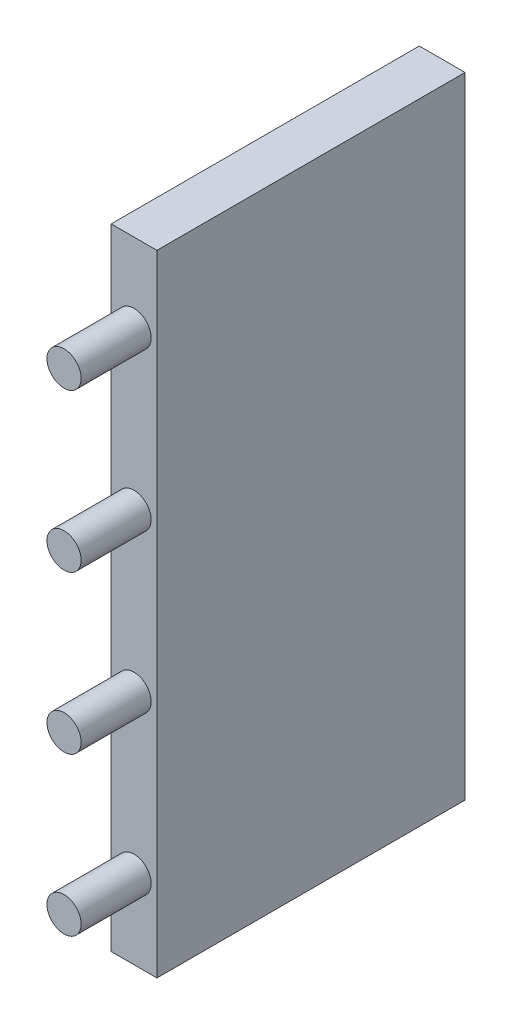
ISO-10303-21;
HEADER;
FILE_DESCRIPTION(('STEP AP214'),'2;1');
FILE_NAME('part.step','',(''),(''),'','','');
FILE_SCHEMA(('AUTOMOTIVE_DESIGN { 1 0 10303 214 1 1 1 1 }'));
ENDSEC;
DATA;
#1=APPLICATION_CONTEXT('core data for automotive mechanical design processes');
#2=APPLICATION_PROTOCOL_DEFINITION('international standard','automotive_design',2000,#1);
#3=PRODUCT_CONTEXT('',#1,'mechanical');
#4=PRODUCT('Part','Part','',(#3));
#5=PRODUCT_RELATED_PRODUCT_CATEGORY('part','',(#4));
#6=PRODUCT_DEFINITION_FORMATION('','',#4);
#7=PRODUCT_DEFINITION_CONTEXT('part definition',#1,'design');
#8=PRODUCT_DEFINITION('design','',#6,#7);
#9=PRODUCT_DEFINITION_SHAPE('','',#8);
#10=(LENGTH_UNIT() NAMED_UNIT(*) SI_UNIT(.MILLI.,.METRE.));
#11=(NAMED_UNIT(*) PLANE_ANGLE_UNIT() SI_UNIT($,.RADIAN.));
#12=(NAMED_UNIT(*) SI_UNIT($,.STERADIAN.) SOLID_ANGLE_UNIT());
#13=UNCERTAINTY_MEASURE_WITH_UNIT(LENGTH_MEASURE(1.E-05),#10,'distance_accuracy_value','');
#14=(GEOMETRIC_REPRESENTATION_CONTEXT(3) GLOBAL_UNCERTAINTY_ASSIGNED_CONTEXT((#13)) GLOBAL_UNIT_ASSIGNED_CONTEXT((#10,
#11,#12)) REPRESENTATION_CONTEXT('',''));
#15=CARTESIAN_POINT('',(0.,0.,0.));
#16=DIRECTION('',(0.,0.,1.));
#17=DIRECTION('',(1.,0.,0.));
#18=AXIS2_PLACEMENT_3D('',#15,#16,#17);
#19=CARTESIAN_POINT('',(8.3,57.15,27.94));
#20=DIRECTION('',(0.,0.,-1.));
#21=DIRECTION('',(0.,1.,0.));
#22=AXIS2_PLACEMENT_3D('',#19,#20,#21);
#23=PLANE('',#22);
#24=CARTESIAN_POINT('',(4.15,14.2875,27.94));
#25=DIRECTION('',(0.,0.,-1.));
#26=DIRECTION('',(0.,1.,0.));
#27=AXIS2_PLACEMENT_3D('',#24,#25,#26);
#28=CIRCLE('',#27,3.1);
#29=CARTESIAN_POINT('',(4.15,17.3875,27.94));
#30=VERTEX_POINT('',#29);
#31=EDGE_CURVE('E42',#30,#30,#28,.F.);
#32=ORIENTED_EDGE('',*,*,#31,.F.);
#33=EDGE_LOOP('',(#32));
#34=FACE_BOUND('',#33,.T.);
#35=CARTESIAN_POINT('',(4.15,-42.8625,27.94));
#36=DIRECTION('',(0.,0.,-1.));
#37=DIRECTION('',(0.,1.,0.));
#38=AXIS2_PLACEMENT_3D('',#35,#36,#37);
#39=CIRCLE('',#38,3.1);
#40=CARTESIAN_POINT('',(4.15,-39.7625,27.94));
#41=VERTEX_POINT('',#40);
#42=EDGE_CURVE('E111',#41,#41,#39,.F.);
#43=ORIENTED_EDGE('',*,*,#42,.F.);
#44=EDGE_LOOP('',(#43));
#45=FACE_BOUND('',#44,.T.);
#46=DIRECTION('',(0.,-1.,0.));
#47=VECTOR('',#46,1.);
#48=CARTESIAN_POINT('',(0.,57.15,27.94));
#49=LINE('',#48,#47);
#50=CARTESIAN_POINT('',(0.,57.15,27.94));
#51=VERTEX_POINT('',#50);
#52=CARTESIAN_POINT('',(0.,-57.15,27.94));
#53=VERTEX_POINT('',#52);
#54=EDGE_CURVE('E101',#51,#53,#49,.T.);
#55=ORIENTED_EDGE('',*,*,#54,.T.);
#56=DIRECTION('',(-1.,0.,0.));
#57=VECTOR('',#56,1.);
#58=CARTESIAN_POINT('',(8.3,-57.15,27.94));
#59=LINE('',#58,#57);
#60=CARTESIAN_POINT('',(8.3,-57.15,27.94));
#61=VERTEX_POINT('',#60);
#62=EDGE_CURVE('E92',#61,#53,#59,.T.);
#63=ORIENTED_EDGE('',*,*,#62,.F.);
#64=DIRECTION('',(0.,-1.,0.));
#65=VECTOR('',#64,1.);
#66=CARTESIAN_POINT('',(8.3,57.15,27.94));
#67=LINE('',#66,#65);
#68=CARTESIAN_POINT('',(8.3,57.15,27.94));
#69=VERTEX_POINT('',#68);
#70=EDGE_CURVE('E86',#69,#61,#67,.T.);
#71=ORIENTED_EDGE('',*,*,#70,.F.);
#72=DIRECTION('',(-1.,0.,0.));
#73=VECTOR('',#72,1.);
#74=CARTESIAN_POINT('',(8.3,57.15,27.94));
#75=LINE('',#74,#73);
#76=EDGE_CURVE('E97',#69,#51,#75,.T.);
#77=ORIENTED_EDGE('',*,*,#76,.T.);
#78=EDGE_LOOP('',(#55,#63,#71,#77));
#79=FACE_BOUND('',#78,.T.);
#80=CARTESIAN_POINT('',(4.15,-14.2875,27.94));
#81=DIRECTION('',(0.,0.,-1.));
#82=DIRECTION('',(0.,1.,0.));
#83=AXIS2_PLACEMENT_3D('',#80,#81,#82);
#84=CIRCLE('',#83,3.1);
#85=CARTESIAN_POINT('',(4.15,-11.1875,27.94));
#86=VERTEX_POINT('',#85);
#87=EDGE_CURVE('E114',#86,#86,#84,.F.);
#88=ORIENTED_EDGE('',*,*,#87,.F.);
#89=EDGE_LOOP('',(#88));
#90=FACE_BOUND('',#89,.T.);
#91=CARTESIAN_POINT('',(4.15,42.8625,27.94));
#92=DIRECTION('',(0.,0.,-1.));
#93=DIRECTION('',(0.,1.,0.));
#94=AXIS2_PLACEMENT_3D('',#91,#92,#93);
#95=CIRCLE('',#94,3.1);
#96=CARTESIAN_POINT('',(4.15,45.9625,27.94));
#97=VERTEX_POINT('',#96);
#98=EDGE_CURVE('E11',#97,#97,#95,.F.);
#99=ORIENTED_EDGE('',*,*,#98,.F.);
#100=EDGE_LOOP('',(#99));
#101=FACE_BOUND('',#100,.T.);
#102=ADVANCED_FACE('F34',(#34,#45,#79,#90,#101),#23,.F.);
#103=CARTESIAN_POINT('',(8.3,-57.15,27.94));
#104=DIRECTION('',(0.,1.,0.));
#105=DIRECTION('',(0.,0.,1.));
#106=AXIS2_PLACEMENT_3D('',#103,#104,#105);
#107=PLANE('',#106);
#108=DIRECTION('',(0.,0.,-1.));
#109=VECTOR('',#108,1.);
#110=CARTESIAN_POINT('',(0.,-57.15,27.94));
#111=LINE('',#110,#109);
#112=CARTESIAN_POINT('',(0.,-57.15,-27.94));
#113=VERTEX_POINT('',#112);
#114=EDGE_CURVE('E91',#53,#113,#111,.T.);
#115=ORIENTED_EDGE('',*,*,#114,.T.);
#116=DIRECTION('',(-1.,0.,0.));
#117=VECTOR('',#116,1.);
#118=CARTESIAN_POINT('',(8.3,-57.15,-27.94));
#119=LINE('',#118,#117);
#120=CARTESIAN_POINT('',(8.3,-57.15,-27.94));
#121=VERTEX_POINT('',#120);
#122=EDGE_CURVE('E89',#121,#113,#119,.T.);
#123=ORIENTED_EDGE('',*,*,#122,.F.);
#124=DIRECTION('',(0.,0.,-1.));
#125=VECTOR('',#124,1.);
#126=CARTESIAN_POINT('',(8.3,-57.15,27.94));
#127=LINE('',#126,#125);
#128=EDGE_CURVE('E81',#61,#121,#127,.T.);
#129=ORIENTED_EDGE('',*,*,#128,.F.);
#130=ORIENTED_EDGE('',*,*,#62,.T.);
#131=EDGE_LOOP('',(#115,#123,#129,#130));
#132=FACE_BOUND('',#131,.T.);
#133=ADVANCED_FACE('F90',(#132),#107,.F.);
#134=CARTESIAN_POINT('',(8.3,57.15,-27.94));
#135=DIRECTION('',(0.,0.,1.));
#136=DIRECTION('',(0.,-1.,0.));
#137=AXIS2_PLACEMENT_3D('',#134,#135,#136);
#138=PLANE('',#137);
#139=DIRECTION('',(0.,1.,0.));
#140=VECTOR('',#139,1.);
#141=CARTESIAN_POINT('',(0.,57.15,-27.94));
#142=LINE('',#141,#140);
#143=CARTESIAN_POINT('',(0.,57.15,-27.94));
#144=VERTEX_POINT('',#143);
#145=EDGE_CURVE('E67',#113,#144,#142,.T.);
#146=ORIENTED_EDGE('',*,*,#145,.T.);
#147=DIRECTION('',(-1.,0.,0.));
#148=VECTOR('',#147,1.);
#149=CARTESIAN_POINT('',(8.3,57.15,-27.94));
#150=LINE('',#149,#148);
#151=CARTESIAN_POINT('',(8.3,57.15,-27.94));
#152=VERTEX_POINT('',#151);
#153=EDGE_CURVE('E93',#152,#144,#150,.T.);
#154=ORIENTED_EDGE('',*,*,#153,.F.);
#155=DIRECTION('',(0.,1.,0.));
#156=VECTOR('',#155,1.);
#157=CARTESIAN_POINT('',(8.3,57.15,-27.94));
#158=LINE('',#157,#156);
#159=EDGE_CURVE('E84',#121,#152,#158,.T.);
#160=ORIENTED_EDGE('',*,*,#159,.F.);
#161=ORIENTED_EDGE('',*,*,#122,.T.);
#162=EDGE_LOOP('',(#146,#154,#160,#161));
#163=FACE_BOUND('',#162,.T.);
#164=ADVANCED_FACE('F95',(#163),#138,.F.);
#165=CARTESIAN_POINT('',(8.3,57.15,27.94));
#166=DIRECTION('',(0.,-1.,0.));
#167=DIRECTION('',(0.,0.,-1.));
#168=AXIS2_PLACEMENT_3D('',#165,#166,#167);
#169=PLANE('',#168);
#170=DIRECTION('',(0.,0.,1.));
#171=VECTOR('',#170,1.);
#172=CARTESIAN_POINT('',(0.,57.15,27.94));
#173=LINE('',#172,#171);
#174=EDGE_CURVE('E73',#144,#51,#173,.T.);
#175=ORIENTED_EDGE('',*,*,#174,.T.);
#176=ORIENTED_EDGE('',*,*,#76,.F.);
#177=DIRECTION('',(0.,0.,1.));
#178=VECTOR('',#177,1.);
#179=CARTESIAN_POINT('',(8.3,57.15,27.94));
#180=LINE('',#179,#178);
#181=EDGE_CURVE('E50',#152,#69,#180,.T.);
#182=ORIENTED_EDGE('',*,*,#181,.F.);
#183=ORIENTED_EDGE('',*,*,#153,.T.);
#184=EDGE_LOOP('',(#175,#176,#182,#183));
#185=FACE_BOUND('',#184,.T.);
#186=ADVANCED_FACE('F169',(#185),#169,.F.);
#187=CARTESIAN_POINT('',(8.3,-57.15,27.94));
#188=DIRECTION('',(1.,0.,0.));
#189=DIRECTION('',(0.,0.,-1.));
#190=AXIS2_PLACEMENT_3D('',#187,#188,#189);
#191=PLANE('',#190);
#192=ORIENTED_EDGE('',*,*,#70,.T.);
#193=ORIENTED_EDGE('',*,*,#128,.T.);
#194=ORIENTED_EDGE('',*,*,#159,.T.);
#195=ORIENTED_EDGE('',*,*,#181,.T.);
#196=EDGE_LOOP('',(#192,#193,#194,#195));
#197=FACE_BOUND('',#196,.T.);
#198=ADVANCED_FACE('F82',(#197),#191,.T.);
#199=CARTESIAN_POINT('',(0.,-57.15,27.94));
#200=DIRECTION('',(1.,0.,0.));
#201=DIRECTION('',(0.,0.,-1.));
#202=AXIS2_PLACEMENT_3D('',#199,#200,#201);
#203=PLANE('',#202);
#204=ORIENTED_EDGE('',*,*,#54,.F.);
#205=ORIENTED_EDGE('',*,*,#174,.F.);
#206=ORIENTED_EDGE('',*,*,#145,.F.);
#207=ORIENTED_EDGE('',*,*,#114,.F.);
#208=EDGE_LOOP('',(#204,#205,#206,#207));
#209=FACE_BOUND('',#208,.T.);
#210=ADVANCED_FACE('F165',(#209),#203,.F.);
#211=CARTESIAN_POINT('',(4.15,-42.8625,40.64));
#212=DIRECTION('',(0.,0.,-1.));
#213=DIRECTION('',(-1.,0.,0.));
#214=AXIS2_PLACEMENT_3D('',#211,#212,#213);
#215=CYLINDRICAL_SURFACE('',#214,3.1);
#216=CARTESIAN_POINT('',(4.15,-42.8625,40.64));
#217=DIRECTION('',(0.,0.,1.));
#218=DIRECTION('',(1.,0.,0.));
#219=AXIS2_PLACEMENT_3D('',#216,#217,#218);
#220=CIRCLE('',#219,3.1);
#221=CARTESIAN_POINT('',(7.25,-42.8625,40.64));
#222=VERTEX_POINT('',#221);
#223=EDGE_CURVE('E104',#222,#222,#220,.T.);
#224=ORIENTED_EDGE('',*,*,#223,.F.);
#225=EDGE_LOOP('',(#224));
#226=FACE_BOUND('',#225,.T.);
#227=ORIENTED_EDGE('',*,*,#42,.T.);
#228=EDGE_LOOP('',(#227));
#229=FACE_BOUND('',#228,.T.);
#230=ADVANCED_FACE('F161',(#226,#229),#215,.T.);
#231=CARTESIAN_POINT('',(4.15,-42.8625,40.64));
#232=DIRECTION('',(0.,0.,1.));
#233=DIRECTION('',(1.,0.,0.));
#234=AXIS2_PLACEMENT_3D('',#231,#232,#233);
#235=PLANE('',#234);
#236=ORIENTED_EDGE('',*,*,#223,.T.);
#237=EDGE_LOOP('',(#236));
#238=FACE_BOUND('',#237,.T.);
#239=ADVANCED_FACE('F157',(#238),#235,.T.);
#240=CARTESIAN_POINT('',(4.15,-14.2875,40.64));
#241=DIRECTION('',(0.,0.,-1.));
#242=DIRECTION('',(-1.,0.,0.));
#243=AXIS2_PLACEMENT_3D('',#240,#241,#242);
#244=CYLINDRICAL_SURFACE('',#243,3.1);
#245=CARTESIAN_POINT('',(4.15,-14.2875,40.64));
#246=DIRECTION('',(0.,0.,1.));
#247=DIRECTION('',(1.,0.,0.));
#248=AXIS2_PLACEMENT_3D('',#245,#246,#247);
#249=CIRCLE('',#248,3.1);
#250=CARTESIAN_POINT('',(7.25,-14.2875,40.64));
#251=VERTEX_POINT('',#250);
#252=EDGE_CURVE('E262',#251,#251,#249,.T.);
#253=ORIENTED_EDGE('',*,*,#252,.F.);
#254=EDGE_LOOP('',(#253));
#255=FACE_BOUND('',#254,.T.);
#256=ORIENTED_EDGE('',*,*,#87,.T.);
#257=EDGE_LOOP('',(#256));
#258=FACE_BOUND('',#257,.T.);
#259=ADVANCED_FACE('F153',(#255,#258),#244,.T.);
#260=CARTESIAN_POINT('',(4.15,-14.2875,40.64));
#261=DIRECTION('',(0.,0.,1.));
#262=DIRECTION('',(1.,0.,0.));
#263=AXIS2_PLACEMENT_3D('',#260,#261,#262);
#264=PLANE('',#263);
#265=ORIENTED_EDGE('',*,*,#252,.T.);
#266=EDGE_LOOP('',(#265));
#267=FACE_BOUND('',#266,.T.);
#268=ADVANCED_FACE('F149',(#267),#264,.T.);
#269=CARTESIAN_POINT('',(4.15,14.2875,40.64));
#270=DIRECTION('',(0.,0.,-1.));
#271=DIRECTION('',(-1.,0.,0.));
#272=AXIS2_PLACEMENT_3D('',#269,#270,#271);
#273=CYLINDRICAL_SURFACE('',#272,3.1);
#274=CARTESIAN_POINT('',(4.15,14.2875,40.64));
#275=DIRECTION('',(0.,0.,1.));
#276=DIRECTION('',(1.,0.,0.));
#277=AXIS2_PLACEMENT_3D('',#274,#275,#276);
#278=CIRCLE('',#277,3.1);
#279=CARTESIAN_POINT('',(7.25,14.2875,40.64));
#280=VERTEX_POINT('',#279);
#281=EDGE_CURVE('E265',#280,#280,#278,.T.);
#282=ORIENTED_EDGE('',*,*,#281,.F.);
#283=EDGE_LOOP('',(#282));
#284=FACE_BOUND('',#283,.T.);
#285=ORIENTED_EDGE('',*,*,#31,.T.);
#286=EDGE_LOOP('',(#285));
#287=FACE_BOUND('',#286,.T.);
#288=ADVANCED_FACE('F119',(#284,#287),#273,.T.);
#289=CARTESIAN_POINT('',(4.15,14.2875,40.64));
#290=DIRECTION('',(0.,0.,1.));
#291=DIRECTION('',(1.,0.,0.));
#292=AXIS2_PLACEMENT_3D('',#289,#290,#291);
#293=PLANE('',#292);
#294=ORIENTED_EDGE('',*,*,#281,.T.);
#295=EDGE_LOOP('',(#294));
#296=FACE_BOUND('',#295,.T.);
#297=ADVANCED_FACE('F134',(#296),#293,.T.);
#298=CARTESIAN_POINT('',(4.15,42.8625,40.64));
#299=DIRECTION('',(0.,0.,-1.));
#300=DIRECTION('',(-1.,0.,0.));
#301=AXIS2_PLACEMENT_3D('',#298,#299,#300);
#302=CYLINDRICAL_SURFACE('',#301,3.1);
#303=CARTESIAN_POINT('',(4.15,42.8625,40.64));
#304=DIRECTION('',(0.,0.,1.));
#305=DIRECTION('',(1.,0.,0.));
#306=AXIS2_PLACEMENT_3D('',#303,#304,#305);
#307=CIRCLE('',#306,3.1);
#308=CARTESIAN_POINT('',(7.25,42.8625,40.64));
#309=VERTEX_POINT('',#308);
#310=EDGE_CURVE('E268',#309,#309,#307,.T.);
#311=ORIENTED_EDGE('',*,*,#310,.F.);
#312=EDGE_LOOP('',(#311));
#313=FACE_BOUND('',#312,.T.);
#314=ORIENTED_EDGE('',*,*,#98,.T.);
#315=EDGE_LOOP('',(#314));
#316=FACE_BOUND('',#315,.T.);
#317=ADVANCED_FACE('F131',(#313,#316),#302,.T.);
#318=CARTESIAN_POINT('',(4.15,42.8625,40.64));
#319=DIRECTION('',(0.,0.,1.));
#320=DIRECTION('',(1.,0.,0.));
#321=AXIS2_PLACEMENT_3D('',#318,#319,#320);
#322=PLANE('',#321);
#323=ORIENTED_EDGE('',*,*,#310,.T.);
#324=EDGE_LOOP('',(#323));
#325=FACE_BOUND('',#324,.T.);
#326=ADVANCED_FACE('F133',(#325),#322,.T.);
#327=CLOSED_SHELL('',(#102,#133,#164,#186,#198,#210,#230,#239,#259,#268,#288,#297,#317,#326));
#328=MANIFOLD_SOLID_BREP('B2',#327);
#329=ADVANCED_BREP_SHAPE_REPRESENTATION('',(#18,#328),#14);
#330=SHAPE_DEFINITION_REPRESENTATION(#9,#329);
ENDSEC;
END-ISO-10303-21;
